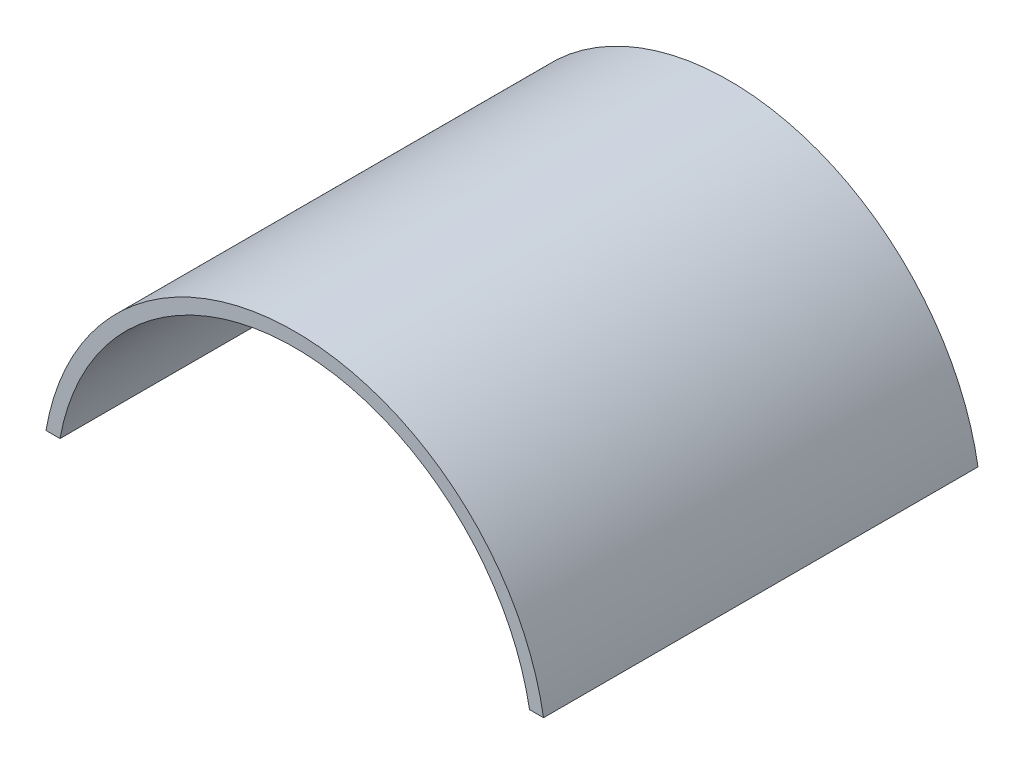
ISO-10303-21;
HEADER;
FILE_DESCRIPTION(('STEP AP214'),'2;1');
FILE_NAME('part.step','',(''),(''),'','','');
FILE_SCHEMA(('AUTOMOTIVE_DESIGN { 1 0 10303 214 1 1 1 1 }'));
ENDSEC;
DATA;
#1=APPLICATION_CONTEXT('core data for automotive mechanical design processes');
#2=APPLICATION_PROTOCOL_DEFINITION('international standard','automotive_design',2000,#1);
#3=PRODUCT_CONTEXT('',#1,'mechanical');
#4=PRODUCT('Part','Part','',(#3));
#5=PRODUCT_RELATED_PRODUCT_CATEGORY('part','',(#4));
#6=PRODUCT_DEFINITION_FORMATION('','',#4);
#7=PRODUCT_DEFINITION_CONTEXT('part definition',#1,'design');
#8=PRODUCT_DEFINITION('design','',#6,#7);
#9=PRODUCT_DEFINITION_SHAPE('','',#8);
#10=(LENGTH_UNIT() NAMED_UNIT(*) SI_UNIT(.MILLI.,.METRE.));
#11=(NAMED_UNIT(*) PLANE_ANGLE_UNIT() SI_UNIT($,.RADIAN.));
#12=(NAMED_UNIT(*) SI_UNIT($,.STERADIAN.) SOLID_ANGLE_UNIT());
#13=UNCERTAINTY_MEASURE_WITH_UNIT(LENGTH_MEASURE(1.E-05),#10,'distance_accuracy_value','');
#14=(GEOMETRIC_REPRESENTATION_CONTEXT(3) GLOBAL_UNCERTAINTY_ASSIGNED_CONTEXT((#13)) GLOBAL_UNIT_ASSIGNED_CONTEXT((#10,
#11,#12)) REPRESENTATION_CONTEXT('',''));
#15=CARTESIAN_POINT('',(0.,0.,0.));
#16=DIRECTION('',(0.,0.,1.));
#17=DIRECTION('',(1.,0.,0.));
#18=AXIS2_PLACEMENT_3D('',#15,#16,#17);
#19=CARTESIAN_POINT('',(0.,-0.880200892857,0.));
#20=DIRECTION('',(0.,0.,-1.));
#21=DIRECTION('',(-1.,0.,0.));
#22=AXIS2_PLACEMENT_3D('',#19,#20,#21);
#23=CYLINDRICAL_SURFACE('',#22,0.170200892857);
#24=CARTESIAN_POINT('',(0.,-0.880200892857,0.));
#25=DIRECTION('',(0.,0.,-1.));
#26=DIRECTION('',(-1.,0.,0.));
#27=AXIS2_PLACEMENT_3D('',#24,#25,#26);
#28=CIRCLE('',#27,0.170200892857);
#29=CARTESIAN_POINT('',(0.16749999999994,-0.85,0.));
#30=VERTEX_POINT('',#29);
#31=CARTESIAN_POINT('',(-0.16749999999994,-0.85,0.));
#32=VERTEX_POINT('',#31);
#33=EDGE_CURVE('E59',#30,#32,#28,.F.);
#34=ORIENTED_EDGE('',*,*,#33,.F.);
#35=DIRECTION('',(0.,0.,-1.));
#36=VECTOR('',#35,1.);
#37=CARTESIAN_POINT('',(0.1675,-0.85,0.));
#38=LINE('',#37,#36);
#39=CARTESIAN_POINT('',(0.16749999999994,-0.85,0.310000002384));
#40=VERTEX_POINT('',#39);
#41=EDGE_CURVE('E55',#40,#30,#38,.T.);
#42=ORIENTED_EDGE('',*,*,#41,.F.);
#43=CARTESIAN_POINT('',(0.,-0.880200892857,0.310000002384));
#44=DIRECTION('',(0.,0.,-1.));
#45=DIRECTION('',(-1.,0.,0.));
#46=AXIS2_PLACEMENT_3D('',#43,#44,#45);
#47=CIRCLE('',#46,0.170200892857);
#48=CARTESIAN_POINT('',(-0.16749999999994,-0.85,0.310000002384));
#49=VERTEX_POINT('',#48);
#50=EDGE_CURVE('E20',#40,#49,#47,.F.);
#51=ORIENTED_EDGE('',*,*,#50,.T.);
#52=DIRECTION('',(0.,0.,-1.));
#53=VECTOR('',#52,1.);
#54=CARTESIAN_POINT('',(-0.1675,-0.85,0.));
#55=LINE('',#54,#53);
#56=EDGE_CURVE('E82',#32,#49,#55,.F.);
#57=ORIENTED_EDGE('',*,*,#56,.F.);
#58=EDGE_LOOP('',(#34,#42,#51,#57));
#59=FACE_BOUND('',#58,.T.);
#60=ADVANCED_FACE('F17',(#59),#23,.F.);
#61=CARTESIAN_POINT('',(0.1675,-0.85,0.310000002384));
#62=DIRECTION('',(0.,0.,-1.));
#63=DIRECTION('',(-1.,0.,0.));
#64=AXIS2_PLACEMENT_3D('',#61,#62,#63);
#65=PLANE('',#64);
#66=DIRECTION('',(1.,0.,0.));
#67=VECTOR('',#66,1.);
#68=CARTESIAN_POINT('',(-0.1675,-0.85,0.310000002384));
#69=LINE('',#68,#67);
#70=CARTESIAN_POINT('',(-0.177499999999722,-0.850000000000023,0.310000002384));
#71=VERTEX_POINT('',#70);
#72=EDGE_CURVE('E69',#49,#71,#69,.F.);
#73=ORIENTED_EDGE('',*,*,#72,.F.);
#74=ORIENTED_EDGE('',*,*,#50,.F.);
#75=DIRECTION('',(1.,0.,0.));
#76=VECTOR('',#75,1.);
#77=CARTESIAN_POINT('',(0.1775,-0.85,0.310000002384));
#78=LINE('',#77,#76);
#79=CARTESIAN_POINT('',(0.177499999999722,-0.850000000000023,0.310000002384));
#80=VERTEX_POINT('',#79);
#81=EDGE_CURVE('E63',#80,#40,#78,.F.);
#82=ORIENTED_EDGE('',*,*,#81,.F.);
#83=CARTESIAN_POINT('',(0.,-0.880020833333,0.310000002384));
#84=DIRECTION('',(0.,0.,-1.));
#85=DIRECTION('',(-1.,0.,0.));
#86=AXIS2_PLACEMENT_3D('',#83,#84,#85);
#87=CIRCLE('',#86,0.180020833333);
#88=EDGE_CURVE('E81',#71,#80,#87,.T.);
#89=ORIENTED_EDGE('',*,*,#88,.F.);
#90=EDGE_LOOP('',(#73,#74,#82,#89));
#91=FACE_BOUND('',#90,.T.);
#92=ADVANCED_FACE('F66',(#91),#65,.F.);
#93=CARTESIAN_POINT('',(0.1775,-0.85,0.));
#94=DIRECTION('',(0.,-1.,0.));
#95=DIRECTION('',(0.,0.,-1.));
#96=AXIS2_PLACEMENT_3D('',#93,#94,#95);
#97=PLANE('',#96);
#98=DIRECTION('',(0.,0.,-1.));
#99=VECTOR('',#98,1.);
#100=CARTESIAN_POINT('',(0.177499999999726,-0.850000000000046,0.));
#101=LINE('',#100,#99);
#102=CARTESIAN_POINT('',(0.177499999999722,-0.850000000000023,0.));
#103=VERTEX_POINT('',#102);
#104=EDGE_CURVE('E73',#80,#103,#101,.T.);
#105=ORIENTED_EDGE('',*,*,#104,.F.);
#106=ORIENTED_EDGE('',*,*,#81,.T.);
#107=ORIENTED_EDGE('',*,*,#41,.T.);
#108=DIRECTION('',(-1.,0.,0.));
#109=VECTOR('',#108,1.);
#110=CARTESIAN_POINT('',(0.1675,-0.85,0.));
#111=LINE('',#110,#109);
#112=EDGE_CURVE('E75',#103,#30,#111,.T.);
#113=ORIENTED_EDGE('',*,*,#112,.F.);
#114=EDGE_LOOP('',(#105,#106,#107,#113));
#115=FACE_BOUND('',#114,.T.);
#116=ADVANCED_FACE('F71',(#115),#97,.T.);
#117=CARTESIAN_POINT('',(0.1675,-0.85,0.));
#118=DIRECTION('',(0.,0.,-1.));
#119=DIRECTION('',(-1.,0.,0.));
#120=AXIS2_PLACEMENT_3D('',#117,#118,#119);
#121=PLANE('',#120);
#122=ORIENTED_EDGE('',*,*,#33,.T.);
#123=DIRECTION('',(1.,0.,0.));
#124=VECTOR('',#123,1.);
#125=CARTESIAN_POINT('',(-0.1675,-0.85,0.));
#126=LINE('',#125,#124);
#127=CARTESIAN_POINT('',(-0.177499999999722,-0.850000000000023,0.));
#128=VERTEX_POINT('',#127);
#129=EDGE_CURVE('E35',#128,#32,#126,.T.);
#130=ORIENTED_EDGE('',*,*,#129,.F.);
#131=CARTESIAN_POINT('',(0.,-0.880020833333,0.));
#132=DIRECTION('',(0.,0.,-1.));
#133=DIRECTION('',(-1.,0.,0.));
#134=AXIS2_PLACEMENT_3D('',#131,#132,#133);
#135=CIRCLE('',#134,0.180020833333);
#136=EDGE_CURVE('E26',#103,#128,#135,.F.);
#137=ORIENTED_EDGE('',*,*,#136,.F.);
#138=ORIENTED_EDGE('',*,*,#112,.T.);
#139=EDGE_LOOP('',(#122,#130,#137,#138));
#140=FACE_BOUND('',#139,.T.);
#141=ADVANCED_FACE('F90',(#140),#121,.T.);
#142=CARTESIAN_POINT('',(-0.1675,-0.85,0.));
#143=DIRECTION('',(0.,-1.,0.));
#144=DIRECTION('',(0.,0.,-1.));
#145=AXIS2_PLACEMENT_3D('',#142,#143,#144);
#146=PLANE('',#145);
#147=ORIENTED_EDGE('',*,*,#56,.T.);
#148=ORIENTED_EDGE('',*,*,#72,.T.);
#149=DIRECTION('',(0.,0.,-1.));
#150=VECTOR('',#149,1.);
#151=CARTESIAN_POINT('',(-0.177499999999726,-0.850000000000046,0.));
#152=LINE('',#151,#150);
#153=EDGE_CURVE('E11',#128,#71,#152,.F.);
#154=ORIENTED_EDGE('',*,*,#153,.F.);
#155=ORIENTED_EDGE('',*,*,#129,.T.);
#156=EDGE_LOOP('',(#147,#148,#154,#155));
#157=FACE_BOUND('',#156,.T.);
#158=ADVANCED_FACE('F87',(#157),#146,.T.);
#159=CARTESIAN_POINT('',(0.,-0.880020833333,0.));
#160=DIRECTION('',(0.,0.,-1.));
#161=DIRECTION('',(-1.,0.,0.));
#162=AXIS2_PLACEMENT_3D('',#159,#160,#161);
#163=CYLINDRICAL_SURFACE('',#162,0.180020833333);
#164=ORIENTED_EDGE('',*,*,#136,.T.);
#165=ORIENTED_EDGE('',*,*,#153,.T.);
#166=ORIENTED_EDGE('',*,*,#88,.T.);
#167=ORIENTED_EDGE('',*,*,#104,.T.);
#168=EDGE_LOOP('',(#164,#165,#166,#167));
#169=FACE_BOUND('',#168,.T.);
#170=ADVANCED_FACE('F89',(#169),#163,.T.);
#171=CLOSED_SHELL('',(#60,#92,#116,#141,#158,#170));
#172=MANIFOLD_SOLID_BREP('B1',#171);
#173=ADVANCED_BREP_SHAPE_REPRESENTATION('',(#18,#172),#14);
#174=SHAPE_DEFINITION_REPRESENTATION(#9,#173);
ENDSEC;
END-ISO-10303-21;
